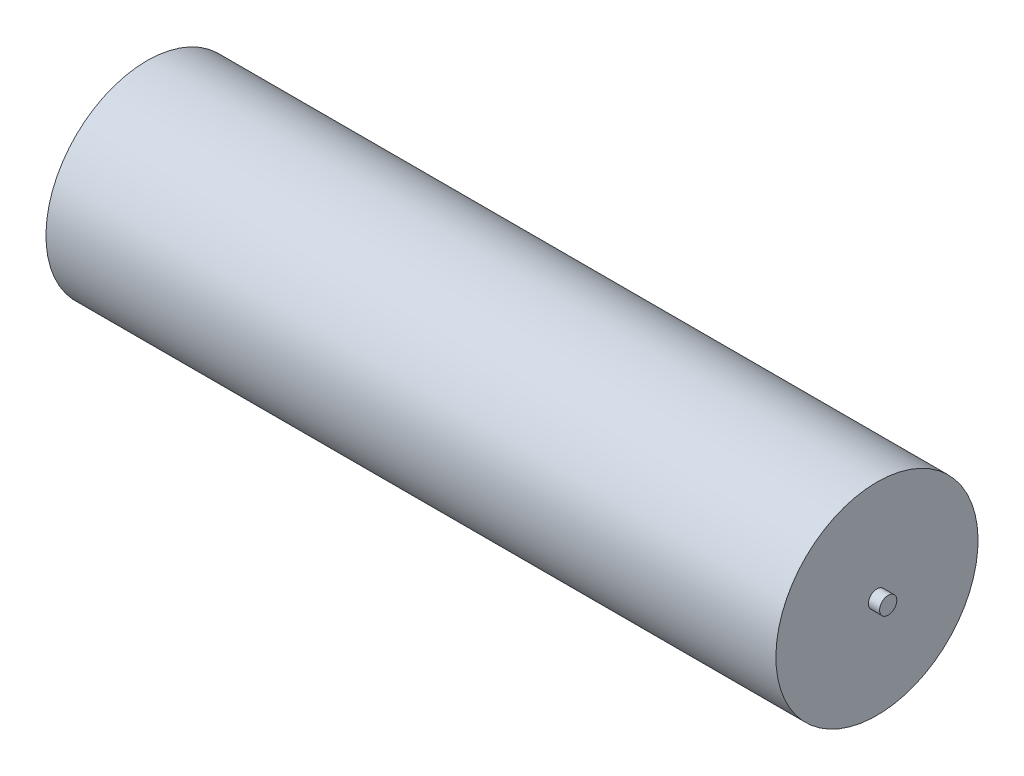
ISO-10303-21;
HEADER;
FILE_DESCRIPTION(('STEP AP214'),'2;1');
FILE_NAME('part.step','',(''),(''),'','','');
FILE_SCHEMA(('AUTOMOTIVE_DESIGN { 1 0 10303 214 1 1 1 1 }'));
ENDSEC;
DATA;
#1=APPLICATION_CONTEXT('core data for automotive mechanical design processes');
#2=APPLICATION_PROTOCOL_DEFINITION('international standard','automotive_design',2000,#1);
#3=PRODUCT_CONTEXT('',#1,'mechanical');
#4=PRODUCT('Part','Part','',(#3));
#5=PRODUCT_RELATED_PRODUCT_CATEGORY('part','',(#4));
#6=PRODUCT_DEFINITION_FORMATION('','',#4);
#7=PRODUCT_DEFINITION_CONTEXT('part definition',#1,'design');
#8=PRODUCT_DEFINITION('design','',#6,#7);
#9=PRODUCT_DEFINITION_SHAPE('','',#8);
#10=(LENGTH_UNIT() NAMED_UNIT(*) SI_UNIT(.MILLI.,.METRE.));
#11=(NAMED_UNIT(*) PLANE_ANGLE_UNIT() SI_UNIT($,.RADIAN.));
#12=(NAMED_UNIT(*) SI_UNIT($,.STERADIAN.) SOLID_ANGLE_UNIT());
#13=UNCERTAINTY_MEASURE_WITH_UNIT(LENGTH_MEASURE(1.E-05),#10,'distance_accuracy_value','');
#14=(GEOMETRIC_REPRESENTATION_CONTEXT(3) GLOBAL_UNCERTAINTY_ASSIGNED_CONTEXT((#13)) GLOBAL_UNIT_ASSIGNED_CONTEXT((#10,
#11,#12)) REPRESENTATION_CONTEXT('',''));
#15=CARTESIAN_POINT('',(0.,0.,0.));
#16=DIRECTION('',(0.,0.,1.));
#17=DIRECTION('',(1.,0.,0.));
#18=AXIS2_PLACEMENT_3D('',#15,#16,#17);
#19=CARTESIAN_POINT('',(0.,-9.00000000000001,0.));
#20=DIRECTION('',(-1.,0.,0.));
#21=DIRECTION('',(0.,-1.,0.));
#22=AXIS2_PLACEMENT_3D('',#19,#20,#21);
#23=PLANE('',#22);
#24=CARTESIAN_POINT('',(0.,-9.00000000000001,0.));
#25=DIRECTION('',(1.,0.,0.));
#26=DIRECTION('',(0.,1.,0.));
#27=AXIS2_PLACEMENT_3D('',#24,#25,#26);
#28=CIRCLE('',#27,9.00000000000001);
#29=CARTESIAN_POINT('',(0.,0.,0.));
#30=VERTEX_POINT('',#29);
#31=EDGE_CURVE('E10',#30,#30,#28,.T.);
#32=ORIENTED_EDGE('',*,*,#31,.F.);
#33=EDGE_LOOP('',(#32));
#34=FACE_BOUND('',#33,.T.);
#35=ADVANCED_FACE('F34',(#34),#23,.T.);
#36=CARTESIAN_POINT('',(65.,-9.,0.));
#37=DIRECTION('',(1.,0.,0.));
#38=DIRECTION('',(0.,1.,0.));
#39=AXIS2_PLACEMENT_3D('',#36,#37,#38);
#40=CYLINDRICAL_SURFACE('',#39,9.00000000000001);
#41=ORIENTED_EDGE('',*,*,#31,.T.);
#42=EDGE_LOOP('',(#41));
#43=FACE_BOUND('',#42,.T.);
#44=CARTESIAN_POINT('',(65.,-9.,0.));
#45=DIRECTION('',(1.,0.,0.));
#46=DIRECTION('',(0.,1.,0.));
#47=AXIS2_PLACEMENT_3D('',#44,#45,#46);
#48=CIRCLE('',#47,9.);
#49=CARTESIAN_POINT('',(65.,0.,0.));
#50=VERTEX_POINT('',#49);
#51=EDGE_CURVE('E40',#50,#50,#48,.T.);
#52=ORIENTED_EDGE('',*,*,#51,.F.);
#53=EDGE_LOOP('',(#52));
#54=FACE_BOUND('',#53,.T.);
#55=ADVANCED_FACE('F58',(#43,#54),#40,.T.);
#56=CARTESIAN_POINT('',(65.,0.,0.));
#57=DIRECTION('',(1.,0.,0.));
#58=DIRECTION('',(0.,1.,0.));
#59=AXIS2_PLACEMENT_3D('',#56,#57,#58);
#60=PLANE('',#59);
#61=CARTESIAN_POINT('',(65.,-9.,0.));
#62=DIRECTION('',(1.,0.,0.));
#63=DIRECTION('',(0.,1.,0.));
#64=AXIS2_PLACEMENT_3D('',#61,#62,#63);
#65=CIRCLE('',#64,0.764525433879077);
#66=CARTESIAN_POINT('',(65.,-8.23547456612093,0.));
#67=VERTEX_POINT('',#66);
#68=EDGE_CURVE('E48',#67,#67,#65,.T.);
#69=ORIENTED_EDGE('',*,*,#68,.F.);
#70=EDGE_LOOP('',(#69));
#71=FACE_BOUND('',#70,.T.);
#72=ORIENTED_EDGE('',*,*,#51,.T.);
#73=EDGE_LOOP('',(#72));
#74=FACE_BOUND('',#73,.T.);
#75=ADVANCED_FACE('F56',(#71,#74),#60,.T.);
#76=CARTESIAN_POINT('',(66.,-9.,0.));
#77=DIRECTION('',(-1.,0.,0.));
#78=DIRECTION('',(0.,-1.,0.));
#79=AXIS2_PLACEMENT_3D('',#76,#77,#78);
#80=CYLINDRICAL_SURFACE('',#79,0.764525433879077);
#81=CARTESIAN_POINT('',(66.,-9.,0.));
#82=DIRECTION('',(1.,0.,0.));
#83=DIRECTION('',(0.,1.,0.));
#84=AXIS2_PLACEMENT_3D('',#81,#82,#83);
#85=CIRCLE('',#84,0.764525433879077);
#86=CARTESIAN_POINT('',(66.,-8.23547456612093,0.));
#87=VERTEX_POINT('',#86);
#88=EDGE_CURVE('E44',#87,#87,#85,.T.);
#89=ORIENTED_EDGE('',*,*,#88,.F.);
#90=EDGE_LOOP('',(#89));
#91=FACE_BOUND('',#90,.T.);
#92=ORIENTED_EDGE('',*,*,#68,.T.);
#93=EDGE_LOOP('',(#92));
#94=FACE_BOUND('',#93,.T.);
#95=ADVANCED_FACE('F54',(#91,#94),#80,.T.);
#96=CARTESIAN_POINT('',(66.,-9.,0.));
#97=DIRECTION('',(1.,0.,0.));
#98=DIRECTION('',(0.,1.,0.));
#99=AXIS2_PLACEMENT_3D('',#96,#97,#98);
#100=PLANE('',#99);
#101=ORIENTED_EDGE('',*,*,#88,.T.);
#102=EDGE_LOOP('',(#101));
#103=FACE_BOUND('',#102,.T.);
#104=ADVANCED_FACE('F64',(#103),#100,.T.);
#105=CLOSED_SHELL('',(#35,#55,#75,#95,#104));
#106=MANIFOLD_SOLID_BREP('B2',#105);
#107=ADVANCED_BREP_SHAPE_REPRESENTATION('',(#18,#106),#14);
#108=SHAPE_DEFINITION_REPRESENTATION(#9,#107);
ENDSEC;
END-ISO-10303-21;
